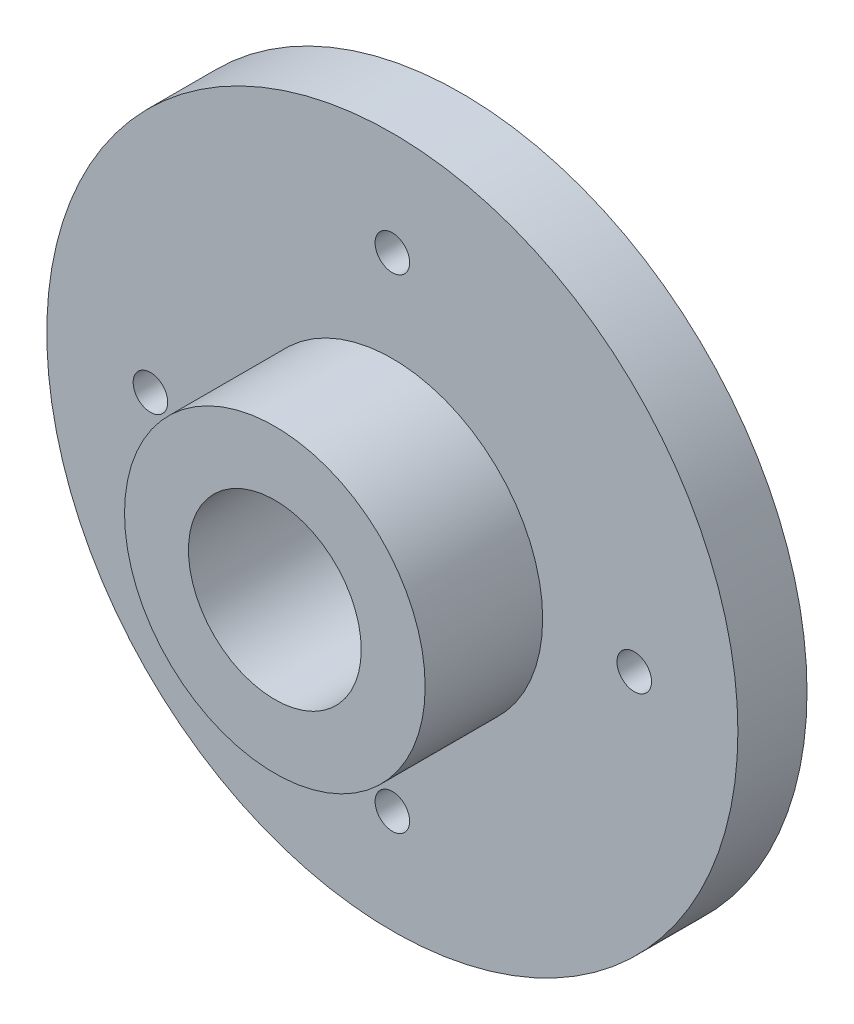
ISO-10303-21;
HEADER;
FILE_DESCRIPTION(('STEP AP214'),'2;1');
FILE_NAME('part.step','',(''),(''),'','','');
FILE_SCHEMA(('AUTOMOTIVE_DESIGN { 1 0 10303 214 1 1 1 1 }'));
ENDSEC;
DATA;
#1=APPLICATION_CONTEXT('core data for automotive mechanical design processes');
#2=APPLICATION_PROTOCOL_DEFINITION('international standard','automotive_design',2000,#1);
#3=PRODUCT_CONTEXT('',#1,'mechanical');
#4=PRODUCT('Part','Part','',(#3));
#5=PRODUCT_RELATED_PRODUCT_CATEGORY('part','',(#4));
#6=PRODUCT_DEFINITION_FORMATION('','',#4);
#7=PRODUCT_DEFINITION_CONTEXT('part definition',#1,'design');
#8=PRODUCT_DEFINITION('design','',#6,#7);
#9=PRODUCT_DEFINITION_SHAPE('','',#8);
#10=(LENGTH_UNIT() NAMED_UNIT(*) SI_UNIT(.MILLI.,.METRE.));
#11=(NAMED_UNIT(*) PLANE_ANGLE_UNIT() SI_UNIT($,.RADIAN.));
#12=(NAMED_UNIT(*) SI_UNIT($,.STERADIAN.) SOLID_ANGLE_UNIT());
#13=UNCERTAINTY_MEASURE_WITH_UNIT(LENGTH_MEASURE(1.E-05),#10,'distance_accuracy_value','');
#14=(GEOMETRIC_REPRESENTATION_CONTEXT(3) GLOBAL_UNCERTAINTY_ASSIGNED_CONTEXT((#13)) GLOBAL_UNIT_ASSIGNED_CONTEXT((#10,
#11,#12)) REPRESENTATION_CONTEXT('',''));
#15=CARTESIAN_POINT('',(0.,0.,0.));
#16=DIRECTION('',(0.,0.,1.));
#17=DIRECTION('',(1.,0.,0.));
#18=AXIS2_PLACEMENT_3D('',#15,#16,#17);
#19=CARTESIAN_POINT('',(0.,0.,9.4));
#20=DIRECTION('',(0.,0.,-1.));
#21=DIRECTION('',(-1.,0.,0.));
#22=AXIS2_PLACEMENT_3D('',#19,#20,#21);
#23=CYLINDRICAL_SURFACE('',#22,1.5);
#24=CARTESIAN_POINT('',(0.,0.,0.));
#25=DIRECTION('',(0.,0.,1.));
#26=DIRECTION('',(1.,0.,0.));
#27=AXIS2_PLACEMENT_3D('',#24,#25,#26);
#28=CIRCLE('',#27,1.5);
#29=CARTESIAN_POINT('',(1.5,0.,0.));
#30=VERTEX_POINT('',#29);
#31=EDGE_CURVE('E65',#30,#30,#28,.T.);
#32=ORIENTED_EDGE('',*,*,#31,.F.);
#33=EDGE_LOOP('',(#32));
#34=FACE_BOUND('',#33,.T.);
#35=CARTESIAN_POINT('',(0.,0.,1.));
#36=DIRECTION('',(0.,0.,1.));
#37=DIRECTION('',(1.,0.,0.));
#38=AXIS2_PLACEMENT_3D('',#35,#36,#37);
#39=CIRCLE('',#38,1.5);
#40=CARTESIAN_POINT('',(1.5,0.,1.));
#41=VERTEX_POINT('',#40);
#42=EDGE_CURVE('E43',#41,#41,#39,.T.);
#43=ORIENTED_EDGE('',*,*,#42,.T.);
#44=EDGE_LOOP('',(#43));
#45=FACE_BOUND('',#44,.T.);
#46=ADVANCED_FACE('F39',(#34,#45),#23,.F.);
#47=CARTESIAN_POINT('',(0.,0.,2.));
#48=DIRECTION('',(0.,0.,-1.));
#49=DIRECTION('',(-1.,0.,0.));
#50=AXIS2_PLACEMENT_3D('',#47,#48,#49);
#51=CYLINDRICAL_SURFACE('',#50,10.);
#52=CARTESIAN_POINT('',(0.,0.,2.));
#53=DIRECTION('',(0.,0.,1.));
#54=DIRECTION('',(1.,0.,0.));
#55=AXIS2_PLACEMENT_3D('',#52,#53,#54);
#56=CIRCLE('',#55,10.);
#57=CARTESIAN_POINT('',(10.,0.,2.));
#58=VERTEX_POINT('',#57);
#59=EDGE_CURVE('E48',#58,#58,#56,.T.);
#60=ORIENTED_EDGE('',*,*,#59,.F.);
#61=EDGE_LOOP('',(#60));
#62=FACE_BOUND('',#61,.T.);
#63=CARTESIAN_POINT('',(0.,0.,0.));
#64=DIRECTION('',(0.,0.,1.));
#65=DIRECTION('',(1.,0.,0.));
#66=AXIS2_PLACEMENT_3D('',#63,#64,#65);
#67=CIRCLE('',#66,10.);
#68=CARTESIAN_POINT('',(10.,0.,0.));
#69=VERTEX_POINT('',#68);
#70=EDGE_CURVE('E54',#69,#69,#67,.T.);
#71=ORIENTED_EDGE('',*,*,#70,.T.);
#72=EDGE_LOOP('',(#71));
#73=FACE_BOUND('',#72,.T.);
#74=ADVANCED_FACE('F41',(#62,#73),#51,.T.);
#75=CARTESIAN_POINT('',(0.,0.,2.));
#76=DIRECTION('',(0.,0.,1.));
#77=DIRECTION('',(1.,0.,0.));
#78=AXIS2_PLACEMENT_3D('',#75,#76,#77);
#79=PLANE('',#78);
#80=CARTESIAN_POINT('',(0.,7.,2.));
#81=DIRECTION('',(0.,0.,1.));
#82=DIRECTION('',(1.,0.,0.));
#83=AXIS2_PLACEMENT_3D('',#80,#81,#82);
#84=CIRCLE('',#83,0.5);
#85=CARTESIAN_POINT('',(0.5,7.,2.));
#86=VERTEX_POINT('',#85);
#87=EDGE_CURVE('E70',#86,#86,#84,.F.);
#88=ORIENTED_EDGE('',*,*,#87,.T.);
#89=EDGE_LOOP('',(#88));
#90=FACE_BOUND('',#89,.T.);
#91=CARTESIAN_POINT('',(7.,0.,2.));
#92=DIRECTION('',(0.,0.,1.));
#93=DIRECTION('',(1.,0.,0.));
#94=AXIS2_PLACEMENT_3D('',#91,#92,#93);
#95=CIRCLE('',#94,0.5);
#96=CARTESIAN_POINT('',(7.5,0.,2.));
#97=VERTEX_POINT('',#96);
#98=EDGE_CURVE('E75',#97,#97,#95,.F.);
#99=ORIENTED_EDGE('',*,*,#98,.T.);
#100=EDGE_LOOP('',(#99));
#101=FACE_BOUND('',#100,.T.);
#102=CARTESIAN_POINT('',(0.,-7.,2.));
#103=DIRECTION('',(0.,0.,1.));
#104=DIRECTION('',(1.,0.,0.));
#105=AXIS2_PLACEMENT_3D('',#102,#103,#104);
#106=CIRCLE('',#105,0.5);
#107=CARTESIAN_POINT('',(0.5,-7.,2.));
#108=VERTEX_POINT('',#107);
#109=EDGE_CURVE('E81',#108,#108,#106,.F.);
#110=ORIENTED_EDGE('',*,*,#109,.T.);
#111=EDGE_LOOP('',(#110));
#112=FACE_BOUND('',#111,.T.);
#113=CARTESIAN_POINT('',(-7.,0.,2.));
#114=DIRECTION('',(0.,0.,1.));
#115=DIRECTION('',(1.,0.,0.));
#116=AXIS2_PLACEMENT_3D('',#113,#114,#115);
#117=CIRCLE('',#116,0.500000000000001);
#118=CARTESIAN_POINT('',(-6.5,0.,2.));
#119=VERTEX_POINT('',#118);
#120=EDGE_CURVE('E85',#119,#119,#117,.F.);
#121=ORIENTED_EDGE('',*,*,#120,.T.);
#122=EDGE_LOOP('',(#121));
#123=FACE_BOUND('',#122,.T.);
#124=CARTESIAN_POINT('',(0.,0.,2.));
#125=DIRECTION('',(0.,0.,1.));
#126=DIRECTION('',(1.,0.,0.));
#127=AXIS2_PLACEMENT_3D('',#124,#125,#126);
#128=CIRCLE('',#127,4.35);
#129=CARTESIAN_POINT('',(4.35,0.,2.));
#130=VERTEX_POINT('',#129);
#131=EDGE_CURVE('E10',#130,#130,#128,.T.);
#132=ORIENTED_EDGE('',*,*,#131,.F.);
#133=EDGE_LOOP('',(#132));
#134=FACE_BOUND('',#133,.T.);
#135=ORIENTED_EDGE('',*,*,#59,.T.);
#136=EDGE_LOOP('',(#135));
#137=FACE_BOUND('',#136,.T.);
#138=ADVANCED_FACE('F135',(#90,#101,#112,#123,#134,#137),#79,.T.);
#139=CARTESIAN_POINT('',(0.,0.,0.));
#140=DIRECTION('',(0.,0.,1.));
#141=DIRECTION('',(1.,0.,0.));
#142=AXIS2_PLACEMENT_3D('',#139,#140,#141);
#143=PLANE('',#142);
#144=CARTESIAN_POINT('',(0.,7.,0.));
#145=DIRECTION('',(0.,0.,1.));
#146=DIRECTION('',(1.,0.,0.));
#147=AXIS2_PLACEMENT_3D('',#144,#145,#146);
#148=CIRCLE('',#147,0.5);
#149=CARTESIAN_POINT('',(0.5,7.,0.));
#150=VERTEX_POINT('',#149);
#151=EDGE_CURVE('E89',#150,#150,#148,.T.);
#152=ORIENTED_EDGE('',*,*,#151,.T.);
#153=EDGE_LOOP('',(#152));
#154=FACE_BOUND('',#153,.T.);
#155=CARTESIAN_POINT('',(7.,0.,0.));
#156=DIRECTION('',(0.,0.,1.));
#157=DIRECTION('',(1.,0.,0.));
#158=AXIS2_PLACEMENT_3D('',#155,#156,#157);
#159=CIRCLE('',#158,0.5);
#160=CARTESIAN_POINT('',(7.5,0.,0.));
#161=VERTEX_POINT('',#160);
#162=EDGE_CURVE('E98',#161,#161,#159,.T.);
#163=ORIENTED_EDGE('',*,*,#162,.T.);
#164=EDGE_LOOP('',(#163));
#165=FACE_BOUND('',#164,.T.);
#166=CARTESIAN_POINT('',(0.,-7.,0.));
#167=DIRECTION('',(0.,0.,1.));
#168=DIRECTION('',(1.,0.,0.));
#169=AXIS2_PLACEMENT_3D('',#166,#167,#168);
#170=CIRCLE('',#169,0.5);
#171=CARTESIAN_POINT('',(0.5,-7.,0.));
#172=VERTEX_POINT('',#171);
#173=EDGE_CURVE('E94',#172,#172,#170,.T.);
#174=ORIENTED_EDGE('',*,*,#173,.T.);
#175=EDGE_LOOP('',(#174));
#176=FACE_BOUND('',#175,.T.);
#177=CARTESIAN_POINT('',(-7.,0.,0.));
#178=DIRECTION('',(0.,0.,1.));
#179=DIRECTION('',(1.,0.,0.));
#180=AXIS2_PLACEMENT_3D('',#177,#178,#179);
#181=CIRCLE('',#180,0.500000000000001);
#182=CARTESIAN_POINT('',(-6.5,0.,0.));
#183=VERTEX_POINT('',#182);
#184=EDGE_CURVE('E90',#183,#183,#181,.T.);
#185=ORIENTED_EDGE('',*,*,#184,.T.);
#186=EDGE_LOOP('',(#185));
#187=FACE_BOUND('',#186,.T.);
#188=ORIENTED_EDGE('',*,*,#31,.T.);
#189=EDGE_LOOP('',(#188));
#190=FACE_BOUND('',#189,.T.);
#191=ORIENTED_EDGE('',*,*,#70,.F.);
#192=EDGE_LOOP('',(#191));
#193=FACE_BOUND('',#192,.T.);
#194=ADVANCED_FACE('F148',(#154,#165,#176,#187,#190,#193),#143,.F.);
#195=CARTESIAN_POINT('',(0.,0.,5.4));
#196=DIRECTION('',(0.,0.,-1.));
#197=DIRECTION('',(-1.,0.,0.));
#198=AXIS2_PLACEMENT_3D('',#195,#196,#197);
#199=CYLINDRICAL_SURFACE('',#198,4.35);
#200=CARTESIAN_POINT('',(0.,0.,5.4));
#201=DIRECTION('',(0.,0.,1.));
#202=DIRECTION('',(1.,0.,0.));
#203=AXIS2_PLACEMENT_3D('',#200,#201,#202);
#204=CIRCLE('',#203,4.35);
#205=CARTESIAN_POINT('',(4.35,0.,5.4));
#206=VERTEX_POINT('',#205);
#207=EDGE_CURVE('E57',#206,#206,#204,.T.);
#208=ORIENTED_EDGE('',*,*,#207,.F.);
#209=EDGE_LOOP('',(#208));
#210=FACE_BOUND('',#209,.T.);
#211=ORIENTED_EDGE('',*,*,#131,.T.);
#212=EDGE_LOOP('',(#211));
#213=FACE_BOUND('',#212,.T.);
#214=ADVANCED_FACE('F144',(#210,#213),#199,.T.);
#215=CARTESIAN_POINT('',(0.,0.,5.4));
#216=DIRECTION('',(0.,0.,1.));
#217=DIRECTION('',(1.,0.,0.));
#218=AXIS2_PLACEMENT_3D('',#215,#216,#217);
#219=PLANE('',#218);
#220=CARTESIAN_POINT('',(0.,0.,5.4));
#221=DIRECTION('',(0.,0.,1.));
#222=DIRECTION('',(1.,0.,0.));
#223=AXIS2_PLACEMENT_3D('',#220,#221,#222);
#224=CIRCLE('',#223,2.5);
#225=CARTESIAN_POINT('',(2.5,0.,5.4));
#226=VERTEX_POINT('',#225);
#227=EDGE_CURVE('E105',#226,#226,#224,.T.);
#228=ORIENTED_EDGE('',*,*,#227,.F.);
#229=EDGE_LOOP('',(#228));
#230=FACE_BOUND('',#229,.T.);
#231=ORIENTED_EDGE('',*,*,#207,.T.);
#232=EDGE_LOOP('',(#231));
#233=FACE_BOUND('',#232,.T.);
#234=ADVANCED_FACE('F141',(#230,#233),#219,.T.);
#235=CARTESIAN_POINT('',(-7.,0.,16.4));
#236=DIRECTION('',(0.,0.,-1.));
#237=DIRECTION('',(-1.,0.,0.));
#238=AXIS2_PLACEMENT_3D('',#235,#236,#237);
#239=CYLINDRICAL_SURFACE('',#238,0.500000000000001);
#240=ORIENTED_EDGE('',*,*,#120,.F.);
#241=EDGE_LOOP('',(#240));
#242=FACE_BOUND('',#241,.T.);
#243=ORIENTED_EDGE('',*,*,#184,.F.);
#244=EDGE_LOOP('',(#243));
#245=FACE_BOUND('',#244,.T.);
#246=ADVANCED_FACE('F139',(#242,#245),#239,.F.);
#247=CARTESIAN_POINT('',(0.,-7.,16.4));
#248=DIRECTION('',(0.,0.,-1.));
#249=DIRECTION('',(-1.,0.,0.));
#250=AXIS2_PLACEMENT_3D('',#247,#248,#249);
#251=CYLINDRICAL_SURFACE('',#250,0.5);
#252=ORIENTED_EDGE('',*,*,#109,.F.);
#253=EDGE_LOOP('',(#252));
#254=FACE_BOUND('',#253,.T.);
#255=ORIENTED_EDGE('',*,*,#173,.F.);
#256=EDGE_LOOP('',(#255));
#257=FACE_BOUND('',#256,.T.);
#258=ADVANCED_FACE('F166',(#254,#257),#251,.F.);
#259=CARTESIAN_POINT('',(7.,0.,16.4));
#260=DIRECTION('',(0.,0.,-1.));
#261=DIRECTION('',(-1.,0.,0.));
#262=AXIS2_PLACEMENT_3D('',#259,#260,#261);
#263=CYLINDRICAL_SURFACE('',#262,0.5);
#264=ORIENTED_EDGE('',*,*,#98,.F.);
#265=EDGE_LOOP('',(#264));
#266=FACE_BOUND('',#265,.T.);
#267=ORIENTED_EDGE('',*,*,#162,.F.);
#268=EDGE_LOOP('',(#267));
#269=FACE_BOUND('',#268,.T.);
#270=ADVANCED_FACE('F171',(#266,#269),#263,.F.);
#271=CARTESIAN_POINT('',(0.,7.,16.4));
#272=DIRECTION('',(0.,0.,-1.));
#273=DIRECTION('',(-1.,0.,0.));
#274=AXIS2_PLACEMENT_3D('',#271,#272,#273);
#275=CYLINDRICAL_SURFACE('',#274,0.5);
#276=ORIENTED_EDGE('',*,*,#87,.F.);
#277=EDGE_LOOP('',(#276));
#278=FACE_BOUND('',#277,.T.);
#279=ORIENTED_EDGE('',*,*,#151,.F.);
#280=EDGE_LOOP('',(#279));
#281=FACE_BOUND('',#280,.T.);
#282=ADVANCED_FACE('F126',(#278,#281),#275,.F.);
#283=CARTESIAN_POINT('',(0.,0.,1.));
#284=DIRECTION('',(0.,0.,1.));
#285=DIRECTION('',(1.,0.,0.));
#286=AXIS2_PLACEMENT_3D('',#283,#284,#285);
#287=CYLINDRICAL_SURFACE('',#286,2.5);
#288=CARTESIAN_POINT('',(0.,0.,1.));
#289=DIRECTION('',(0.,0.,1.));
#290=DIRECTION('',(1.,0.,0.));
#291=AXIS2_PLACEMENT_3D('',#288,#289,#290);
#292=CIRCLE('',#291,2.5);
#293=CARTESIAN_POINT('',(2.5,0.,1.));
#294=VERTEX_POINT('',#293);
#295=EDGE_CURVE('E109',#294,#294,#292,.T.);
#296=ORIENTED_EDGE('',*,*,#295,.F.);
#297=EDGE_LOOP('',(#296));
#298=FACE_BOUND('',#297,.T.);
#299=ORIENTED_EDGE('',*,*,#227,.T.);
#300=EDGE_LOOP('',(#299));
#301=FACE_BOUND('',#300,.T.);
#302=ADVANCED_FACE('F121',(#298,#301),#287,.F.);
#303=CARTESIAN_POINT('',(0.,0.,1.));
#304=DIRECTION('',(0.,0.,1.));
#305=DIRECTION('',(1.,0.,0.));
#306=AXIS2_PLACEMENT_3D('',#303,#304,#305);
#307=PLANE('',#306);
#308=ORIENTED_EDGE('',*,*,#42,.F.);
#309=EDGE_LOOP('',(#308));
#310=FACE_BOUND('',#309,.T.);
#311=ORIENTED_EDGE('',*,*,#295,.T.);
#312=EDGE_LOOP('',(#311));
#313=FACE_BOUND('',#312,.T.);
#314=ADVANCED_FACE('F119',(#310,#313),#307,.T.);
#315=CLOSED_SHELL('',(#46,#74,#138,#194,#214,#234,#246,#258,#270,#282,#302,#314));
#316=MANIFOLD_SOLID_BREP('B2',#315);
#317=ADVANCED_BREP_SHAPE_REPRESENTATION('',(#18,#316),#14);
#318=SHAPE_DEFINITION_REPRESENTATION(#9,#317);
ENDSEC;
END-ISO-10303-21;
